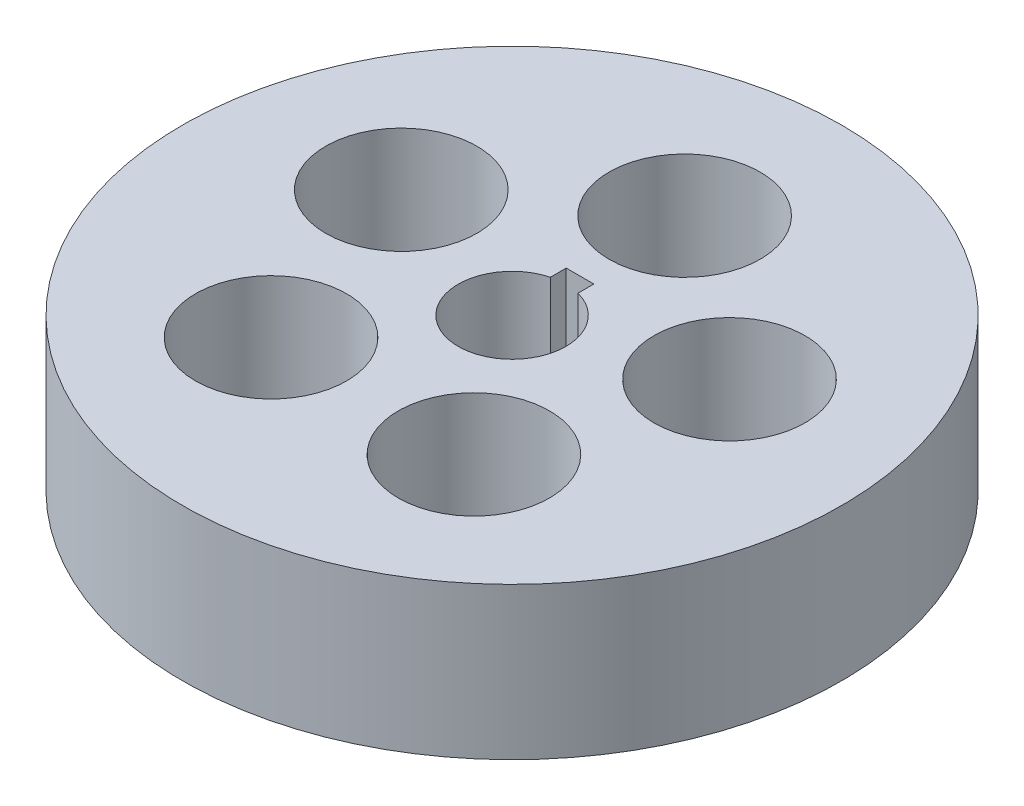
ISO-10303-21;
HEADER;
FILE_DESCRIPTION(('STEP AP214'),'2;1');
FILE_NAME('part.step','',(''),(''),'','','');
FILE_SCHEMA(('AUTOMOTIVE_DESIGN { 1 0 10303 214 1 1 1 1 }'));
ENDSEC;
DATA;
#1=APPLICATION_CONTEXT('core data for automotive mechanical design processes');
#2=APPLICATION_PROTOCOL_DEFINITION('international standard','automotive_design',2000,#1);
#3=PRODUCT_CONTEXT('',#1,'mechanical');
#4=PRODUCT('Part','Part','',(#3));
#5=PRODUCT_RELATED_PRODUCT_CATEGORY('part','',(#4));
#6=PRODUCT_DEFINITION_FORMATION('','',#4);
#7=PRODUCT_DEFINITION_CONTEXT('part definition',#1,'design');
#8=PRODUCT_DEFINITION('design','',#6,#7);
#9=PRODUCT_DEFINITION_SHAPE('','',#8);
#10=(LENGTH_UNIT() NAMED_UNIT(*) SI_UNIT(.MILLI.,.METRE.));
#11=(NAMED_UNIT(*) PLANE_ANGLE_UNIT() SI_UNIT($,.RADIAN.));
#12=(NAMED_UNIT(*) SI_UNIT($,.STERADIAN.) SOLID_ANGLE_UNIT());
#13=UNCERTAINTY_MEASURE_WITH_UNIT(LENGTH_MEASURE(1.E-05),#10,'distance_accuracy_value','');
#14=(GEOMETRIC_REPRESENTATION_CONTEXT(3) GLOBAL_UNCERTAINTY_ASSIGNED_CONTEXT((#13)) GLOBAL_UNIT_ASSIGNED_CONTEXT((#10,
#11,#12)) REPRESENTATION_CONTEXT('',''));
#15=CARTESIAN_POINT('',(0.,0.,0.));
#16=DIRECTION('',(0.,0.,1.));
#17=DIRECTION('',(1.,0.,0.));
#18=AXIS2_PLACEMENT_3D('',#15,#16,#17);
#19=CARTESIAN_POINT('',(-1.016,0.,-5.0038));
#20=DIRECTION('',(-1.,0.,0.));
#21=DIRECTION('',(0.,0.,1.));
#22=AXIS2_PLACEMENT_3D('',#19,#20,#21);
#23=PLANE('',#22);
#24=DIRECTION('',(0.,1.,0.));
#25=VECTOR('',#24,1.);
#26=CARTESIAN_POINT('',(-1.016,0.,-3.83649847680147));
#27=LINE('',#26,#25);
#28=CARTESIAN_POINT('',(-1.016,11.176,-3.83649847680147));
#29=VERTEX_POINT('',#28);
#30=CARTESIAN_POINT('',(-1.016,0.,-3.83649847680147));
#31=VERTEX_POINT('',#30);
#32=EDGE_CURVE('E64',#29,#31,#27,.F.);
#33=ORIENTED_EDGE('',*,*,#32,.T.);
#34=DIRECTION('',(0.,0.,1.));
#35=VECTOR('',#34,1.);
#36=CARTESIAN_POINT('',(-1.016,0.,-5.0038));
#37=LINE('',#36,#35);
#38=CARTESIAN_POINT('',(-1.016,0.,-5.0038));
#39=VERTEX_POINT('',#38);
#40=EDGE_CURVE('E35',#39,#31,#37,.T.);
#41=ORIENTED_EDGE('',*,*,#40,.F.);
#42=DIRECTION('',(0.,1.,0.));
#43=VECTOR('',#42,1.);
#44=CARTESIAN_POINT('',(-1.016,0.,-5.0038));
#45=LINE('',#44,#43);
#46=CARTESIAN_POINT('',(-1.016,11.176,-5.0038));
#47=VERTEX_POINT('',#46);
#48=EDGE_CURVE('E101',#47,#39,#45,.F.);
#49=ORIENTED_EDGE('',*,*,#48,.F.);
#50=DIRECTION('',(0.,0.,1.));
#51=VECTOR('',#50,1.);
#52=CARTESIAN_POINT('',(-1.016,11.176,0.));
#53=LINE('',#52,#51);
#54=EDGE_CURVE('E49',#29,#47,#53,.F.);
#55=ORIENTED_EDGE('',*,*,#54,.F.);
#56=EDGE_LOOP('',(#33,#41,#49,#55));
#57=FACE_BOUND('',#56,.T.);
#58=ADVANCED_FACE('F17',(#57),#23,.F.);
#59=CARTESIAN_POINT('',(1.016,0.,-5.0038));
#60=DIRECTION('',(-1.,0.,0.));
#61=DIRECTION('',(0.,0.,1.));
#62=AXIS2_PLACEMENT_3D('',#59,#60,#61);
#63=PLANE('',#62);
#64=DIRECTION('',(0.,0.,1.));
#65=VECTOR('',#64,1.);
#66=CARTESIAN_POINT('',(1.016,0.,-5.0038));
#67=LINE('',#66,#65);
#68=CARTESIAN_POINT('',(1.016,0.,-5.0038));
#69=VERTEX_POINT('',#68);
#70=CARTESIAN_POINT('',(1.016,0.,-3.83649847680147));
#71=VERTEX_POINT('',#70);
#72=EDGE_CURVE('E79',#69,#71,#67,.T.);
#73=ORIENTED_EDGE('',*,*,#72,.T.);
#74=DIRECTION('',(0.,1.,0.));
#75=VECTOR('',#74,1.);
#76=CARTESIAN_POINT('',(1.016,0.,-3.83649847680147));
#77=LINE('',#76,#75);
#78=CARTESIAN_POINT('',(1.016,11.176,-3.83649847680147));
#79=VERTEX_POINT('',#78);
#80=EDGE_CURVE('E62',#71,#79,#77,.T.);
#81=ORIENTED_EDGE('',*,*,#80,.T.);
#82=DIRECTION('',(0.,0.,1.));
#83=VECTOR('',#82,1.);
#84=CARTESIAN_POINT('',(1.016,11.176,0.));
#85=LINE('',#84,#83);
#86=CARTESIAN_POINT('',(1.016,11.176,-5.0038));
#87=VERTEX_POINT('',#86);
#88=EDGE_CURVE('E68',#87,#79,#85,.T.);
#89=ORIENTED_EDGE('',*,*,#88,.F.);
#90=DIRECTION('',(0.,1.,0.));
#91=VECTOR('',#90,1.);
#92=CARTESIAN_POINT('',(1.016,0.,-5.0038));
#93=LINE('',#92,#91);
#94=EDGE_CURVE('E98',#69,#87,#93,.T.);
#95=ORIENTED_EDGE('',*,*,#94,.F.);
#96=EDGE_LOOP('',(#73,#81,#89,#95));
#97=FACE_BOUND('',#96,.T.);
#98=ADVANCED_FACE('F77',(#97),#63,.T.);
#99=CARTESIAN_POINT('',(0.,11.176,0.));
#100=DIRECTION('',(0.,1.,0.));
#101=DIRECTION('',(0.,0.,1.));
#102=AXIS2_PLACEMENT_3D('',#99,#100,#101);
#103=PLANE('',#102);
#104=CARTESIAN_POINT('',(0.,11.176,0.));
#105=DIRECTION('',(0.,-1.,0.));
#106=DIRECTION('',(0.,0.,-1.));
#107=AXIS2_PLACEMENT_3D('',#104,#105,#106);
#108=CIRCLE('',#107,24.257);
#109=CARTESIAN_POINT('',(0.,11.176,-24.257));
#110=VERTEX_POINT('',#109);
#111=EDGE_CURVE('E100',#110,#110,#108,.T.);
#112=ORIENTED_EDGE('',*,*,#111,.F.);
#113=EDGE_LOOP('',(#112));
#114=FACE_BOUND('',#113,.T.);
#115=ORIENTED_EDGE('',*,*,#88,.T.);
#116=CARTESIAN_POINT('',(0.,11.176,0.));
#117=DIRECTION('',(0.,1.,0.));
#118=DIRECTION('',(0.,0.,1.));
#119=AXIS2_PLACEMENT_3D('',#116,#117,#118);
#120=CIRCLE('',#119,3.96875);
#121=EDGE_CURVE('E58',#79,#29,#120,.F.);
#122=ORIENTED_EDGE('',*,*,#121,.T.);
#123=ORIENTED_EDGE('',*,*,#54,.T.);
#124=DIRECTION('',(1.,0.,0.));
#125=VECTOR('',#124,1.);
#126=CARTESIAN_POINT('',(-1.016,11.176,-5.0038));
#127=LINE('',#126,#125);
#128=EDGE_CURVE('E72',#87,#47,#127,.F.);
#129=ORIENTED_EDGE('',*,*,#128,.F.);
#130=EDGE_LOOP('',(#115,#122,#123,#129));
#131=FACE_BOUND('',#130,.T.);
#132=CARTESIAN_POINT('',(0.,11.176,-12.7));
#133=DIRECTION('',(0.,1.,0.));
#134=DIRECTION('',(0.,0.,1.));
#135=AXIS2_PLACEMENT_3D('',#132,#133,#134);
#136=CIRCLE('',#135,5.5626);
#137=CARTESIAN_POINT('',(0.,11.176,-7.1374));
#138=VERTEX_POINT('',#137);
#139=EDGE_CURVE('E80',#138,#138,#136,.F.);
#140=ORIENTED_EDGE('',*,*,#139,.T.);
#141=EDGE_LOOP('',(#140));
#142=FACE_BOUND('',#141,.T.);
#143=CARTESIAN_POINT('',(12.0784177569485,11.176,-3.9245158285618));
#144=DIRECTION('',(0.,1.,0.));
#145=DIRECTION('',(0.,0.,1.));
#146=AXIS2_PLACEMENT_3D('',#143,#144,#145);
#147=CIRCLE('',#146,5.5626);
#148=CARTESIAN_POINT('',(12.0784177569485,11.176,1.6380841714382));
#149=VERTEX_POINT('',#148);
#150=EDGE_CURVE('E83',#149,#149,#147,.F.);
#151=ORIENTED_EDGE('',*,*,#150,.T.);
#152=EDGE_LOOP('',(#151));
#153=FACE_BOUND('',#152,.T.);
#154=CARTESIAN_POINT('',(7.46487270411435,11.176,10.2745158285619));
#155=DIRECTION('',(0.,1.,0.));
#156=DIRECTION('',(0.,0.,1.));
#157=AXIS2_PLACEMENT_3D('',#154,#155,#156);
#158=CIRCLE('',#157,5.5626);
#159=CARTESIAN_POINT('',(7.46487270411435,11.176,15.8371158285619));
#160=VERTEX_POINT('',#159);
#161=EDGE_CURVE('E135',#160,#160,#158,.F.);
#162=ORIENTED_EDGE('',*,*,#161,.T.);
#163=EDGE_LOOP('',(#162));
#164=FACE_BOUND('',#163,.T.);
#165=CARTESIAN_POINT('',(-7.4648727041145,11.176,10.2745158285618));
#166=DIRECTION('',(0.,1.,0.));
#167=DIRECTION('',(0.,0.,1.));
#168=AXIS2_PLACEMENT_3D('',#165,#166,#167);
#169=CIRCLE('',#168,5.5626);
#170=CARTESIAN_POINT('',(-7.4648727041145,11.176,15.8371158285618));
#171=VERTEX_POINT('',#170);
#172=EDGE_CURVE('E137',#171,#171,#169,.F.);
#173=ORIENTED_EDGE('',*,*,#172,.T.);
#174=EDGE_LOOP('',(#173));
#175=FACE_BOUND('',#174,.T.);
#176=CARTESIAN_POINT('',(-12.0784177569484,11.176,-3.92451582856197));
#177=DIRECTION('',(0.,1.,0.));
#178=DIRECTION('',(0.,0.,1.));
#179=AXIS2_PLACEMENT_3D('',#176,#177,#178);
#180=CIRCLE('',#179,5.5626);
#181=CARTESIAN_POINT('',(-12.0784177569484,11.176,1.63808417143803));
#182=VERTEX_POINT('',#181);
#183=EDGE_CURVE('E20',#182,#182,#180,.F.);
#184=ORIENTED_EDGE('',*,*,#183,.T.);
#185=EDGE_LOOP('',(#184));
#186=FACE_BOUND('',#185,.T.);
#187=ADVANCED_FACE('F69',(#114,#131,#142,#153,#164,#175,#186),#103,.T.);
#188=CARTESIAN_POINT('',(-12.0784177569484,0.,-3.92451582856197));
#189=DIRECTION('',(0.,1.,0.));
#190=DIRECTION('',(0.,0.,1.));
#191=AXIS2_PLACEMENT_3D('',#188,#189,#190);
#192=CYLINDRICAL_SURFACE('',#191,5.5626);
#193=CARTESIAN_POINT('',(-12.0784177569484,0.,-3.92451582856197));
#194=DIRECTION('',(0.,1.,0.));
#195=DIRECTION('',(0.,0.,1.));
#196=AXIS2_PLACEMENT_3D('',#193,#194,#195);
#197=CIRCLE('',#196,5.5626);
#198=CARTESIAN_POINT('',(-12.0784177569484,0.,1.63808417143803));
#199=VERTEX_POINT('',#198);
#200=EDGE_CURVE('E128',#199,#199,#197,.F.);
#201=ORIENTED_EDGE('',*,*,#200,.T.);
#202=EDGE_LOOP('',(#201));
#203=FACE_BOUND('',#202,.T.);
#204=ORIENTED_EDGE('',*,*,#183,.F.);
#205=EDGE_LOOP('',(#204));
#206=FACE_BOUND('',#205,.T.);
#207=ADVANCED_FACE('F145',(#203,#206),#192,.F.);
#208=CARTESIAN_POINT('',(-7.4648727041145,0.,10.2745158285618));
#209=DIRECTION('',(0.,1.,0.));
#210=DIRECTION('',(0.,0.,1.));
#211=AXIS2_PLACEMENT_3D('',#208,#209,#210);
#212=CYLINDRICAL_SURFACE('',#211,5.5626);
#213=CARTESIAN_POINT('',(-7.4648727041145,0.,10.2745158285618));
#214=DIRECTION('',(0.,1.,0.));
#215=DIRECTION('',(0.,0.,1.));
#216=AXIS2_PLACEMENT_3D('',#213,#214,#215);
#217=CIRCLE('',#216,5.5626);
#218=CARTESIAN_POINT('',(-7.4648727041145,0.,15.8371158285618));
#219=VERTEX_POINT('',#218);
#220=EDGE_CURVE('E125',#219,#219,#217,.F.);
#221=ORIENTED_EDGE('',*,*,#220,.T.);
#222=EDGE_LOOP('',(#221));
#223=FACE_BOUND('',#222,.T.);
#224=ORIENTED_EDGE('',*,*,#172,.F.);
#225=EDGE_LOOP('',(#224));
#226=FACE_BOUND('',#225,.T.);
#227=ADVANCED_FACE('F147',(#223,#226),#212,.F.);
#228=CARTESIAN_POINT('',(7.46487270411435,0.,10.2745158285619));
#229=DIRECTION('',(0.,1.,0.));
#230=DIRECTION('',(0.,0.,1.));
#231=AXIS2_PLACEMENT_3D('',#228,#229,#230);
#232=CYLINDRICAL_SURFACE('',#231,5.5626);
#233=CARTESIAN_POINT('',(7.46487270411435,0.,10.2745158285619));
#234=DIRECTION('',(0.,1.,0.));
#235=DIRECTION('',(0.,0.,1.));
#236=AXIS2_PLACEMENT_3D('',#233,#234,#235);
#237=CIRCLE('',#236,5.5626);
#238=CARTESIAN_POINT('',(7.46487270411435,0.,15.8371158285619));
#239=VERTEX_POINT('',#238);
#240=EDGE_CURVE('E122',#239,#239,#237,.F.);
#241=ORIENTED_EDGE('',*,*,#240,.T.);
#242=EDGE_LOOP('',(#241));
#243=FACE_BOUND('',#242,.T.);
#244=ORIENTED_EDGE('',*,*,#161,.F.);
#245=EDGE_LOOP('',(#244));
#246=FACE_BOUND('',#245,.T.);
#247=ADVANCED_FACE('F155',(#243,#246),#232,.F.);
#248=CARTESIAN_POINT('',(12.0784177569485,0.,-3.9245158285618));
#249=DIRECTION('',(0.,1.,0.));
#250=DIRECTION('',(0.,0.,1.));
#251=AXIS2_PLACEMENT_3D('',#248,#249,#250);
#252=CYLINDRICAL_SURFACE('',#251,5.5626);
#253=CARTESIAN_POINT('',(12.0784177569485,0.,-3.9245158285618));
#254=DIRECTION('',(0.,1.,0.));
#255=DIRECTION('',(0.,0.,1.));
#256=AXIS2_PLACEMENT_3D('',#253,#254,#255);
#257=CIRCLE('',#256,5.5626);
#258=CARTESIAN_POINT('',(12.0784177569485,0.,1.6380841714382));
#259=VERTEX_POINT('',#258);
#260=EDGE_CURVE('E119',#259,#259,#257,.F.);
#261=ORIENTED_EDGE('',*,*,#260,.T.);
#262=EDGE_LOOP('',(#261));
#263=FACE_BOUND('',#262,.T.);
#264=ORIENTED_EDGE('',*,*,#150,.F.);
#265=EDGE_LOOP('',(#264));
#266=FACE_BOUND('',#265,.T.);
#267=ADVANCED_FACE('F182',(#263,#266),#252,.F.);
#268=CARTESIAN_POINT('',(0.,0.,-12.7));
#269=DIRECTION('',(0.,1.,0.));
#270=DIRECTION('',(0.,0.,1.));
#271=AXIS2_PLACEMENT_3D('',#268,#269,#270);
#272=CYLINDRICAL_SURFACE('',#271,5.5626);
#273=CARTESIAN_POINT('',(0.,0.,-12.7));
#274=DIRECTION('',(0.,1.,0.));
#275=DIRECTION('',(0.,0.,1.));
#276=AXIS2_PLACEMENT_3D('',#273,#274,#275);
#277=CIRCLE('',#276,5.5626);
#278=CARTESIAN_POINT('',(0.,0.,-7.1374));
#279=VERTEX_POINT('',#278);
#280=EDGE_CURVE('E116',#279,#279,#277,.F.);
#281=ORIENTED_EDGE('',*,*,#280,.T.);
#282=EDGE_LOOP('',(#281));
#283=FACE_BOUND('',#282,.T.);
#284=ORIENTED_EDGE('',*,*,#139,.F.);
#285=EDGE_LOOP('',(#284));
#286=FACE_BOUND('',#285,.T.);
#287=ADVANCED_FACE('F179',(#283,#286),#272,.F.);
#288=CARTESIAN_POINT('',(0.,0.,0.));
#289=DIRECTION('',(0.,1.,0.));
#290=DIRECTION('',(0.,0.,1.));
#291=AXIS2_PLACEMENT_3D('',#288,#289,#290);
#292=CYLINDRICAL_SURFACE('',#291,3.96875);
#293=CARTESIAN_POINT('',(0.,0.,0.));
#294=DIRECTION('',(0.,1.,0.));
#295=DIRECTION('',(0.,0.,1.));
#296=AXIS2_PLACEMENT_3D('',#293,#294,#295);
#297=CIRCLE('',#296,3.96875);
#298=EDGE_CURVE('E112',#71,#31,#297,.F.);
#299=ORIENTED_EDGE('',*,*,#298,.T.);
#300=ORIENTED_EDGE('',*,*,#32,.F.);
#301=ORIENTED_EDGE('',*,*,#121,.F.);
#302=ORIENTED_EDGE('',*,*,#80,.F.);
#303=EDGE_LOOP('',(#299,#300,#301,#302));
#304=FACE_BOUND('',#303,.T.);
#305=ADVANCED_FACE('F60',(#304),#292,.F.);
#306=CARTESIAN_POINT('',(-1.016,0.,-5.0038));
#307=DIRECTION('',(0.,0.,1.));
#308=DIRECTION('',(1.,0.,0.));
#309=AXIS2_PLACEMENT_3D('',#306,#307,#308);
#310=PLANE('',#309);
#311=DIRECTION('',(1.,0.,0.));
#312=VECTOR('',#311,1.);
#313=CARTESIAN_POINT('',(0.,0.,-5.0038));
#314=LINE('',#313,#312);
#315=EDGE_CURVE('E26',#39,#69,#314,.T.);
#316=ORIENTED_EDGE('',*,*,#315,.T.);
#317=ORIENTED_EDGE('',*,*,#94,.T.);
#318=ORIENTED_EDGE('',*,*,#128,.T.);
#319=ORIENTED_EDGE('',*,*,#48,.T.);
#320=EDGE_LOOP('',(#316,#317,#318,#319));
#321=FACE_BOUND('',#320,.T.);
#322=ADVANCED_FACE('F168',(#321),#310,.T.);
#323=CARTESIAN_POINT('',(0.,11.176,0.));
#324=DIRECTION('',(0.,-1.,0.));
#325=DIRECTION('',(0.,0.,-1.));
#326=AXIS2_PLACEMENT_3D('',#323,#324,#325);
#327=CYLINDRICAL_SURFACE('',#326,24.257);
#328=ORIENTED_EDGE('',*,*,#111,.T.);
#329=EDGE_LOOP('',(#328));
#330=FACE_BOUND('',#329,.T.);
#331=CARTESIAN_POINT('',(0.,0.,0.));
#332=DIRECTION('',(0.,-1.,0.));
#333=DIRECTION('',(0.,0.,-1.));
#334=AXIS2_PLACEMENT_3D('',#331,#332,#333);
#335=CIRCLE('',#334,24.257);
#336=CARTESIAN_POINT('',(0.,0.,-24.257));
#337=VERTEX_POINT('',#336);
#338=EDGE_CURVE('E11',#337,#337,#335,.F.);
#339=ORIENTED_EDGE('',*,*,#338,.T.);
#340=EDGE_LOOP('',(#339));
#341=FACE_BOUND('',#340,.T.);
#342=ADVANCED_FACE('F162',(#330,#341),#327,.T.);
#343=CARTESIAN_POINT('',(0.,0.,0.));
#344=DIRECTION('',(0.,1.,0.));
#345=DIRECTION('',(0.,0.,1.));
#346=AXIS2_PLACEMENT_3D('',#343,#344,#345);
#347=PLANE('',#346);
#348=ORIENTED_EDGE('',*,*,#338,.F.);
#349=EDGE_LOOP('',(#348));
#350=FACE_BOUND('',#349,.T.);
#351=ORIENTED_EDGE('',*,*,#40,.T.);
#352=ORIENTED_EDGE('',*,*,#298,.F.);
#353=ORIENTED_EDGE('',*,*,#72,.F.);
#354=ORIENTED_EDGE('',*,*,#315,.F.);
#355=EDGE_LOOP('',(#351,#352,#353,#354));
#356=FACE_BOUND('',#355,.T.);
#357=ORIENTED_EDGE('',*,*,#280,.F.);
#358=EDGE_LOOP('',(#357));
#359=FACE_BOUND('',#358,.T.);
#360=ORIENTED_EDGE('',*,*,#260,.F.);
#361=EDGE_LOOP('',(#360));
#362=FACE_BOUND('',#361,.T.);
#363=ORIENTED_EDGE('',*,*,#240,.F.);
#364=EDGE_LOOP('',(#363));
#365=FACE_BOUND('',#364,.T.);
#366=ORIENTED_EDGE('',*,*,#220,.F.);
#367=EDGE_LOOP('',(#366));
#368=FACE_BOUND('',#367,.T.);
#369=ORIENTED_EDGE('',*,*,#200,.F.);
#370=EDGE_LOOP('',(#369));
#371=FACE_BOUND('',#370,.T.);
#372=ADVANCED_FACE('F160',(#350,#356,#359,#362,#365,#368,#371),#347,.F.);
#373=CLOSED_SHELL('',(#58,#98,#187,#207,#227,#247,#267,#287,#305,#322,#342,#372));
#374=MANIFOLD_SOLID_BREP('B1',#373);
#375=ADVANCED_BREP_SHAPE_REPRESENTATION('',(#18,#374),#14);
#376=SHAPE_DEFINITION_REPRESENTATION(#9,#375);
ENDSEC;
END-ISO-10303-21;
